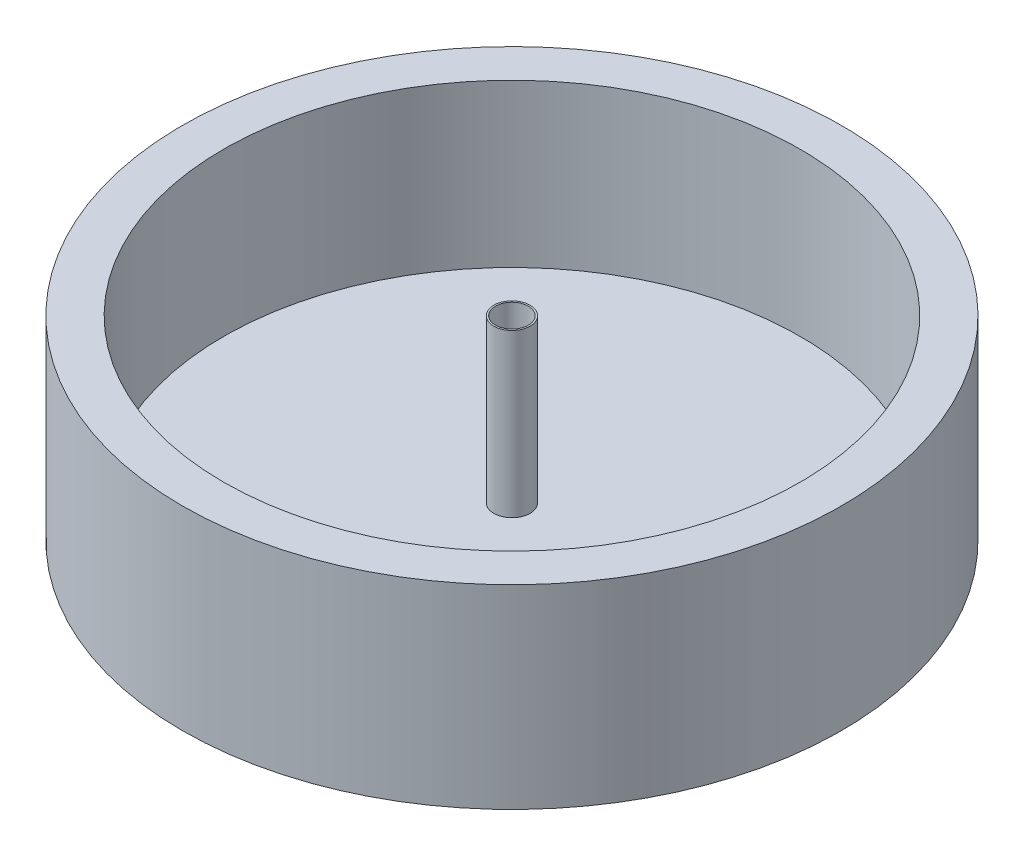
ISO-10303-21;
HEADER;
FILE_DESCRIPTION(('STEP AP214'),'2;1');
FILE_NAME('part.step','',(''),(''),'','','');
FILE_SCHEMA(('AUTOMOTIVE_DESIGN { 1 0 10303 214 1 1 1 1 }'));
ENDSEC;
DATA;
#1=APPLICATION_CONTEXT('core data for automotive mechanical design processes');
#2=APPLICATION_PROTOCOL_DEFINITION('international standard','automotive_design',2000,#1);
#3=PRODUCT_CONTEXT('',#1,'mechanical');
#4=PRODUCT('Part','Part','',(#3));
#5=PRODUCT_RELATED_PRODUCT_CATEGORY('part','',(#4));
#6=PRODUCT_DEFINITION_FORMATION('','',#4);
#7=PRODUCT_DEFINITION_CONTEXT('part definition',#1,'design');
#8=PRODUCT_DEFINITION('design','',#6,#7);
#9=PRODUCT_DEFINITION_SHAPE('','',#8);
#10=(LENGTH_UNIT() NAMED_UNIT(*) SI_UNIT(.MILLI.,.METRE.));
#11=(NAMED_UNIT(*) PLANE_ANGLE_UNIT() SI_UNIT($,.RADIAN.));
#12=(NAMED_UNIT(*) SI_UNIT($,.STERADIAN.) SOLID_ANGLE_UNIT());
#13=UNCERTAINTY_MEASURE_WITH_UNIT(LENGTH_MEASURE(1.E-05),#10,'distance_accuracy_value','');
#14=(GEOMETRIC_REPRESENTATION_CONTEXT(3) GLOBAL_UNCERTAINTY_ASSIGNED_CONTEXT((#13)) GLOBAL_UNIT_ASSIGNED_CONTEXT((#10,
#11,#12)) REPRESENTATION_CONTEXT('',''));
#15=CARTESIAN_POINT('',(0.,0.,0.));
#16=DIRECTION('',(0.,0.,1.));
#17=DIRECTION('',(1.,0.,0.));
#18=AXIS2_PLACEMENT_3D('',#15,#16,#17);
#19=CARTESIAN_POINT('',(0.,30.,0.));
#20=DIRECTION('',(0.,-1.,0.));
#21=DIRECTION('',(0.,0.,-1.));
#22=AXIS2_PLACEMENT_3D('',#19,#20,#21);
#23=CYLINDRICAL_SURFACE('',#22,50.8);
#24=CARTESIAN_POINT('',(0.,30.,0.));
#25=DIRECTION('',(0.,1.,0.));
#26=DIRECTION('',(0.,0.,1.));
#27=AXIS2_PLACEMENT_3D('',#24,#25,#26);
#28=CIRCLE('',#27,50.8);
#29=CARTESIAN_POINT('',(0.,30.,50.8));
#30=VERTEX_POINT('',#29);
#31=EDGE_CURVE('E10',#30,#30,#28,.T.);
#32=ORIENTED_EDGE('',*,*,#31,.F.);
#33=EDGE_LOOP('',(#32));
#34=FACE_BOUND('',#33,.T.);
#35=CARTESIAN_POINT('',(0.,0.,0.));
#36=DIRECTION('',(0.,1.,0.));
#37=DIRECTION('',(0.,0.,1.));
#38=AXIS2_PLACEMENT_3D('',#35,#36,#37);
#39=CIRCLE('',#38,50.8);
#40=CARTESIAN_POINT('',(0.,0.,50.8));
#41=VERTEX_POINT('',#40);
#42=EDGE_CURVE('E40',#41,#41,#39,.T.);
#43=ORIENTED_EDGE('',*,*,#42,.T.);
#44=EDGE_LOOP('',(#43));
#45=FACE_BOUND('',#44,.T.);
#46=ADVANCED_FACE('F37',(#34,#45),#23,.T.);
#47=CARTESIAN_POINT('',(0.,30.,0.));
#48=DIRECTION('',(0.,1.,0.));
#49=DIRECTION('',(0.,0.,1.));
#50=AXIS2_PLACEMENT_3D('',#47,#48,#49);
#51=PLANE('',#50);
#52=CARTESIAN_POINT('',(0.,30.,0.));
#53=DIRECTION('',(0.,1.,0.));
#54=DIRECTION('',(0.,0.,1.));
#55=AXIS2_PLACEMENT_3D('',#52,#53,#54);
#56=CIRCLE('',#55,44.45);
#57=CARTESIAN_POINT('',(0.,30.,44.45));
#58=VERTEX_POINT('',#57);
#59=EDGE_CURVE('E51',#58,#58,#56,.T.);
#60=ORIENTED_EDGE('',*,*,#59,.F.);
#61=EDGE_LOOP('',(#60));
#62=FACE_BOUND('',#61,.T.);
#63=ORIENTED_EDGE('',*,*,#31,.T.);
#64=EDGE_LOOP('',(#63));
#65=FACE_BOUND('',#64,.T.);
#66=ADVANCED_FACE('F108',(#62,#65),#51,.T.);
#67=CARTESIAN_POINT('',(0.,0.,0.));
#68=DIRECTION('',(0.,1.,0.));
#69=DIRECTION('',(0.,0.,1.));
#70=AXIS2_PLACEMENT_3D('',#67,#68,#69);
#71=PLANE('',#70);
#72=ORIENTED_EDGE('',*,*,#42,.F.);
#73=EDGE_LOOP('',(#72));
#74=FACE_BOUND('',#73,.T.);
#75=ADVANCED_FACE('F104',(#74),#71,.F.);
#76=CARTESIAN_POINT('',(0.,5.00000000000001,0.));
#77=DIRECTION('',(0.,1.,0.));
#78=DIRECTION('',(0.,0.,1.));
#79=AXIS2_PLACEMENT_3D('',#76,#77,#78);
#80=CYLINDRICAL_SURFACE('',#79,44.45);
#81=CARTESIAN_POINT('',(0.,5.00000000000001,0.));
#82=DIRECTION('',(0.,1.,0.));
#83=DIRECTION('',(0.,0.,1.));
#84=AXIS2_PLACEMENT_3D('',#81,#82,#83);
#85=CIRCLE('',#84,44.45);
#86=CARTESIAN_POINT('',(0.,5.00000000000001,44.45));
#87=VERTEX_POINT('',#86);
#88=EDGE_CURVE('E49',#87,#87,#85,.T.);
#89=ORIENTED_EDGE('',*,*,#88,.F.);
#90=EDGE_LOOP('',(#89));
#91=FACE_BOUND('',#90,.T.);
#92=ORIENTED_EDGE('',*,*,#59,.T.);
#93=EDGE_LOOP('',(#92));
#94=FACE_BOUND('',#93,.T.);
#95=ADVANCED_FACE('F98',(#91,#94),#80,.F.);
#96=CARTESIAN_POINT('',(0.,5.00000000000001,0.));
#97=DIRECTION('',(0.,1.,0.));
#98=DIRECTION('',(0.,0.,1.));
#99=AXIS2_PLACEMENT_3D('',#96,#97,#98);
#100=PLANE('',#99);
#101=CARTESIAN_POINT('',(0.,5.00000000000001,0.));
#102=DIRECTION('',(0.,1.,0.));
#103=DIRECTION('',(0.,0.,1.));
#104=AXIS2_PLACEMENT_3D('',#101,#102,#103);
#105=CIRCLE('',#104,2.794);
#106=CARTESIAN_POINT('',(0.,5.00000000000001,2.794));
#107=VERTEX_POINT('',#106);
#108=EDGE_CURVE('E59',#107,#107,#105,.T.);
#109=ORIENTED_EDGE('',*,*,#108,.F.);
#110=EDGE_LOOP('',(#109));
#111=FACE_BOUND('',#110,.T.);
#112=ORIENTED_EDGE('',*,*,#88,.T.);
#113=EDGE_LOOP('',(#112));
#114=FACE_BOUND('',#113,.T.);
#115=ADVANCED_FACE('F92',(#111,#114),#100,.T.);
#116=CARTESIAN_POINT('',(0.,30.,0.));
#117=DIRECTION('',(0.,-1.,0.));
#118=DIRECTION('',(0.,0.,-1.));
#119=AXIS2_PLACEMENT_3D('',#116,#117,#118);
#120=CYLINDRICAL_SURFACE('',#119,2.794);
#121=CARTESIAN_POINT('',(0.,30.,0.));
#122=DIRECTION('',(0.,1.,0.));
#123=DIRECTION('',(0.,0.,1.));
#124=AXIS2_PLACEMENT_3D('',#121,#122,#123);
#125=CIRCLE('',#124,2.794);
#126=CARTESIAN_POINT('',(0.,30.,2.794));
#127=VERTEX_POINT('',#126);
#128=EDGE_CURVE('E55',#127,#127,#125,.T.);
#129=ORIENTED_EDGE('',*,*,#128,.F.);
#130=EDGE_LOOP('',(#129));
#131=FACE_BOUND('',#130,.T.);
#132=ORIENTED_EDGE('',*,*,#108,.T.);
#133=EDGE_LOOP('',(#132));
#134=FACE_BOUND('',#133,.T.);
#135=ADVANCED_FACE('F86',(#131,#134),#120,.T.);
#136=CARTESIAN_POINT('',(0.,30.,0.));
#137=DIRECTION('',(0.,1.,0.));
#138=DIRECTION('',(0.,0.,1.));
#139=AXIS2_PLACEMENT_3D('',#136,#137,#138);
#140=PLANE('',#139);
#141=CARTESIAN_POINT('',(0.,30.,0.));
#142=DIRECTION('',(0.,1.,0.));
#143=DIRECTION('',(0.,0.,1.));
#144=AXIS2_PLACEMENT_3D('',#141,#142,#143);
#145=CIRCLE('',#144,2.54);
#146=CARTESIAN_POINT('',(0.,30.,2.54));
#147=VERTEX_POINT('',#146);
#148=EDGE_CURVE('E67',#147,#147,#145,.T.);
#149=ORIENTED_EDGE('',*,*,#148,.F.);
#150=EDGE_LOOP('',(#149));
#151=FACE_BOUND('',#150,.T.);
#152=ORIENTED_EDGE('',*,*,#128,.T.);
#153=EDGE_LOOP('',(#152));
#154=FACE_BOUND('',#153,.T.);
#155=ADVANCED_FACE('F80',(#151,#154),#140,.T.);
#156=CARTESIAN_POINT('',(0.,5.00000000000001,0.));
#157=DIRECTION('',(0.,1.,0.));
#158=DIRECTION('',(0.,0.,1.));
#159=AXIS2_PLACEMENT_3D('',#156,#157,#158);
#160=CYLINDRICAL_SURFACE('',#159,2.54);
#161=CARTESIAN_POINT('',(0.,5.00000000000001,0.));
#162=DIRECTION('',(0.,1.,0.));
#163=DIRECTION('',(0.,0.,1.));
#164=AXIS2_PLACEMENT_3D('',#161,#162,#163);
#165=CIRCLE('',#164,2.54);
#166=CARTESIAN_POINT('',(0.,5.00000000000001,2.54));
#167=VERTEX_POINT('',#166);
#168=EDGE_CURVE('E63',#167,#167,#165,.T.);
#169=ORIENTED_EDGE('',*,*,#168,.F.);
#170=EDGE_LOOP('',(#169));
#171=FACE_BOUND('',#170,.T.);
#172=ORIENTED_EDGE('',*,*,#148,.T.);
#173=EDGE_LOOP('',(#172));
#174=FACE_BOUND('',#173,.T.);
#175=ADVANCED_FACE('F77',(#171,#174),#160,.F.);
#176=CARTESIAN_POINT('',(0.,5.00000000000001,0.));
#177=DIRECTION('',(0.,1.,0.));
#178=DIRECTION('',(0.,0.,1.));
#179=AXIS2_PLACEMENT_3D('',#176,#177,#178);
#180=PLANE('',#179);
#181=ORIENTED_EDGE('',*,*,#168,.T.);
#182=EDGE_LOOP('',(#181));
#183=FACE_BOUND('',#182,.T.);
#184=ADVANCED_FACE('F75',(#183),#180,.T.);
#185=CLOSED_SHELL('',(#46,#66,#75,#95,#115,#135,#155,#175,#184));
#186=MANIFOLD_SOLID_BREP('B2',#185);
#187=ADVANCED_BREP_SHAPE_REPRESENTATION('',(#18,#186),#14);
#188=SHAPE_DEFINITION_REPRESENTATION(#9,#187);
ENDSEC;
END-ISO-10303-21;
